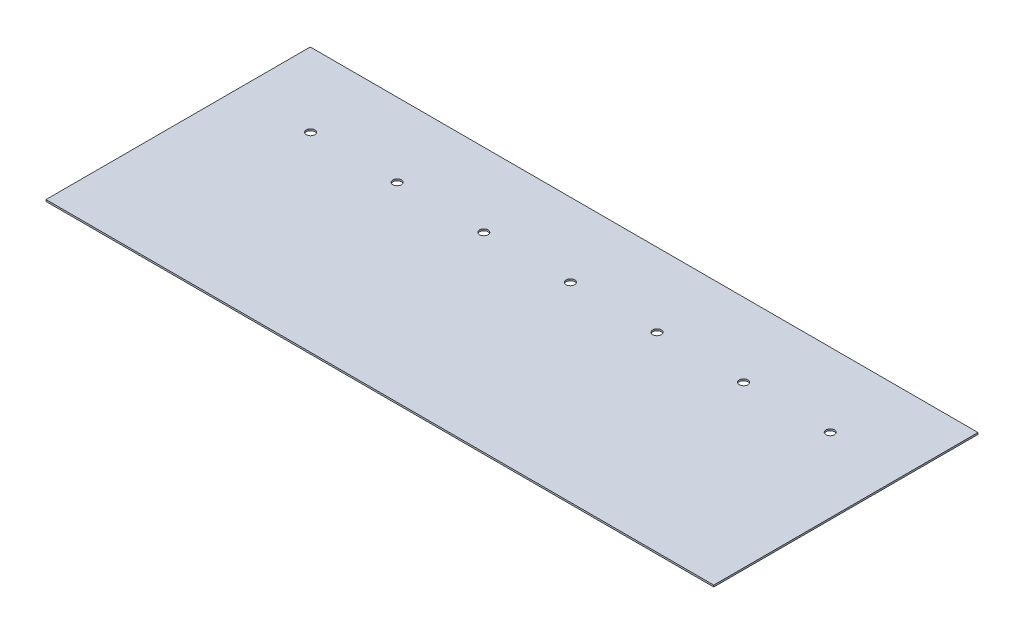
ISO-10303-21;
HEADER;
FILE_DESCRIPTION(('STEP AP214'),'2;1');
FILE_NAME('part.step','',(''),(''),'','','');
FILE_SCHEMA(('AUTOMOTIVE_DESIGN { 1 0 10303 214 1 1 1 1 }'));
ENDSEC;
DATA;
#1=APPLICATION_CONTEXT('core data for automotive mechanical design processes');
#2=APPLICATION_PROTOCOL_DEFINITION('international standard','automotive_design',2000,#1);
#3=PRODUCT_CONTEXT('',#1,'mechanical');
#4=PRODUCT('Part','Part','',(#3));
#5=PRODUCT_RELATED_PRODUCT_CATEGORY('part','',(#4));
#6=PRODUCT_DEFINITION_FORMATION('','',#4);
#7=PRODUCT_DEFINITION_CONTEXT('part definition',#1,'design');
#8=PRODUCT_DEFINITION('design','',#6,#7);
#9=PRODUCT_DEFINITION_SHAPE('','',#8);
#10=(LENGTH_UNIT() NAMED_UNIT(*) SI_UNIT(.MILLI.,.METRE.));
#11=(NAMED_UNIT(*) PLANE_ANGLE_UNIT() SI_UNIT($,.RADIAN.));
#12=(NAMED_UNIT(*) SI_UNIT($,.STERADIAN.) SOLID_ANGLE_UNIT());
#13=UNCERTAINTY_MEASURE_WITH_UNIT(LENGTH_MEASURE(1.E-05),#10,'distance_accuracy_value','');
#14=(GEOMETRIC_REPRESENTATION_CONTEXT(3) GLOBAL_UNCERTAINTY_ASSIGNED_CONTEXT((#13)) GLOBAL_UNIT_ASSIGNED_CONTEXT((#10,
#11,#12)) REPRESENTATION_CONTEXT('',''));
#15=CARTESIAN_POINT('',(0.,0.,0.));
#16=DIRECTION('',(0.,0.,1.));
#17=DIRECTION('',(1.,0.,0.));
#18=AXIS2_PLACEMENT_3D('',#15,#16,#17);
#19=CARTESIAN_POINT('',(391.668,-1.,0.));
#20=DIRECTION('',(-1.,0.,0.));
#21=DIRECTION('',(0.,0.,1.));
#22=AXIS2_PLACEMENT_3D('',#19,#20,#21);
#23=PLANE('',#22);
#24=DIRECTION('',(0.,0.,1.));
#25=VECTOR('',#24,1.);
#26=CARTESIAN_POINT('',(391.668,-1.,0.));
#27=LINE('',#26,#25);
#28=CARTESIAN_POINT('',(391.668,-1.,45.));
#29=VERTEX_POINT('',#28);
#30=CARTESIAN_POINT('',(391.668,-1.,199.9996));
#31=VERTEX_POINT('',#30);
#32=EDGE_CURVE('E62',#29,#31,#27,.T.);
#33=ORIENTED_EDGE('',*,*,#32,.F.);
#34=DIRECTION('',(0.,1.,0.));
#35=VECTOR('',#34,1.);
#36=CARTESIAN_POINT('',(391.668,-1.,45.));
#37=LINE('',#36,#35);
#38=CARTESIAN_POINT('',(391.668,0.,45.));
#39=VERTEX_POINT('',#38);
#40=EDGE_CURVE('E80',#29,#39,#37,.T.);
#41=ORIENTED_EDGE('',*,*,#40,.T.);
#42=DIRECTION('',(0.,0.,1.));
#43=VECTOR('',#42,1.);
#44=CARTESIAN_POINT('',(391.668,0.,0.));
#45=LINE('',#44,#43);
#46=CARTESIAN_POINT('',(391.668,0.,199.9996));
#47=VERTEX_POINT('',#46);
#48=EDGE_CURVE('E76',#39,#47,#45,.T.);
#49=ORIENTED_EDGE('',*,*,#48,.T.);
#50=DIRECTION('',(0.,1.,0.));
#51=VECTOR('',#50,1.);
#52=CARTESIAN_POINT('',(391.668,-1.,199.9996));
#53=LINE('',#52,#51);
#54=EDGE_CURVE('E47',#31,#47,#53,.T.);
#55=ORIENTED_EDGE('',*,*,#54,.F.);
#56=EDGE_LOOP('',(#33,#41,#49,#55));
#57=FACE_BOUND('',#56,.T.);
#58=ADVANCED_FACE('F39',(#57),#23,.F.);
#59=CARTESIAN_POINT('',(0.,-1.,199.9996));
#60=DIRECTION('',(0.,0.,1.));
#61=DIRECTION('',(1.,0.,0.));
#62=AXIS2_PLACEMENT_3D('',#59,#60,#61);
#63=PLANE('',#62);
#64=DIRECTION('',(1.,0.,0.));
#65=VECTOR('',#64,1.);
#66=CARTESIAN_POINT('',(0.,0.,199.9996));
#67=LINE('',#66,#65);
#68=CARTESIAN_POINT('',(0.,0.,199.9996));
#69=VERTEX_POINT('',#68);
#70=EDGE_CURVE('E90',#69,#47,#67,.T.);
#71=ORIENTED_EDGE('',*,*,#70,.F.);
#72=DIRECTION('',(0.,1.,0.));
#73=VECTOR('',#72,1.);
#74=CARTESIAN_POINT('',(0.,-1.,199.9996));
#75=LINE('',#74,#73);
#76=CARTESIAN_POINT('',(0.,-1.,199.9996));
#77=VERTEX_POINT('',#76);
#78=EDGE_CURVE('E92',#77,#69,#75,.T.);
#79=ORIENTED_EDGE('',*,*,#78,.F.);
#80=DIRECTION('',(1.,0.,0.));
#81=VECTOR('',#80,1.);
#82=CARTESIAN_POINT('',(0.,-1.,199.9996));
#83=LINE('',#82,#81);
#84=EDGE_CURVE('E91',#77,#31,#83,.T.);
#85=ORIENTED_EDGE('',*,*,#84,.T.);
#86=ORIENTED_EDGE('',*,*,#54,.T.);
#87=EDGE_LOOP('',(#71,#79,#85,#86));
#88=FACE_BOUND('',#87,.T.);
#89=ADVANCED_FACE('F88',(#88),#63,.T.);
#90=CARTESIAN_POINT('',(0.,-1.,0.));
#91=DIRECTION('',(-1.,0.,0.));
#92=DIRECTION('',(0.,0.,1.));
#93=AXIS2_PLACEMENT_3D('',#90,#91,#92);
#94=PLANE('',#93);
#95=DIRECTION('',(0.,1.,0.));
#96=VECTOR('',#95,1.);
#97=CARTESIAN_POINT('',(0.,-1.,45.));
#98=LINE('',#97,#96);
#99=CARTESIAN_POINT('',(0.,-1.,45.));
#100=VERTEX_POINT('',#99);
#101=CARTESIAN_POINT('',(0.,0.,45.));
#102=VERTEX_POINT('',#101);
#103=EDGE_CURVE('E53',#100,#102,#98,.T.);
#104=ORIENTED_EDGE('',*,*,#103,.F.);
#105=DIRECTION('',(0.,0.,1.));
#106=VECTOR('',#105,1.);
#107=CARTESIAN_POINT('',(0.,-1.,0.));
#108=LINE('',#107,#106);
#109=EDGE_CURVE('E105',#100,#77,#108,.T.);
#110=ORIENTED_EDGE('',*,*,#109,.T.);
#111=ORIENTED_EDGE('',*,*,#78,.T.);
#112=DIRECTION('',(0.,0.,1.));
#113=VECTOR('',#112,1.);
#114=CARTESIAN_POINT('',(0.,0.,0.));
#115=LINE('',#114,#113);
#116=EDGE_CURVE('E83',#102,#69,#115,.T.);
#117=ORIENTED_EDGE('',*,*,#116,.F.);
#118=EDGE_LOOP('',(#104,#110,#111,#117));
#119=FACE_BOUND('',#118,.T.);
#120=ADVANCED_FACE('F150',(#119),#94,.T.);
#121=CARTESIAN_POINT('',(195.834,-1.,88.2396));
#122=DIRECTION('',(0.,1.,0.));
#123=DIRECTION('',(0.,0.,1.));
#124=AXIS2_PLACEMENT_3D('',#121,#122,#123);
#125=CYLINDRICAL_SURFACE('',#124,2.5);
#126=CARTESIAN_POINT('',(195.834,-1.,88.2396));
#127=DIRECTION('',(0.,1.,0.));
#128=DIRECTION('',(0.,0.,1.));
#129=AXIS2_PLACEMENT_3D('',#126,#127,#128);
#130=CIRCLE('',#129,2.5);
#131=CARTESIAN_POINT('',(195.834,-1.,90.7396));
#132=VERTEX_POINT('',#131);
#133=EDGE_CURVE('E211',#132,#132,#130,.T.);
#134=ORIENTED_EDGE('',*,*,#133,.F.);
#135=EDGE_LOOP('',(#134));
#136=FACE_BOUND('',#135,.T.);
#137=CARTESIAN_POINT('',(195.834,0.,88.2396));
#138=DIRECTION('',(0.,1.,0.));
#139=DIRECTION('',(0.,0.,1.));
#140=AXIS2_PLACEMENT_3D('',#137,#138,#139);
#141=CIRCLE('',#140,2.5);
#142=CARTESIAN_POINT('',(195.834,0.,90.7396));
#143=VERTEX_POINT('',#142);
#144=EDGE_CURVE('E84',#143,#143,#141,.T.);
#145=ORIENTED_EDGE('',*,*,#144,.T.);
#146=EDGE_LOOP('',(#145));
#147=FACE_BOUND('',#146,.T.);
#148=ADVANCED_FACE('F131',(#136,#147),#125,.F.);
#149=CARTESIAN_POINT('',(145.034,-1.,88.2396));
#150=DIRECTION('',(0.,1.,0.));
#151=DIRECTION('',(0.,0.,1.));
#152=AXIS2_PLACEMENT_3D('',#149,#150,#151);
#153=CYLINDRICAL_SURFACE('',#152,2.49999999999997);
#154=CARTESIAN_POINT('',(145.034,-1.,88.2396));
#155=DIRECTION('',(0.,1.,0.));
#156=DIRECTION('',(0.,0.,1.));
#157=AXIS2_PLACEMENT_3D('',#154,#155,#156);
#158=CIRCLE('',#157,2.49999999999997);
#159=CARTESIAN_POINT('',(145.034,-1.,90.7396));
#160=VERTEX_POINT('',#159);
#161=EDGE_CURVE('E208',#160,#160,#158,.T.);
#162=ORIENTED_EDGE('',*,*,#161,.F.);
#163=EDGE_LOOP('',(#162));
#164=FACE_BOUND('',#163,.T.);
#165=CARTESIAN_POINT('',(145.034,0.,88.2396));
#166=DIRECTION('',(0.,1.,0.));
#167=DIRECTION('',(0.,0.,1.));
#168=AXIS2_PLACEMENT_3D('',#165,#166,#167);
#169=CIRCLE('',#168,2.49999999999997);
#170=CARTESIAN_POINT('',(145.034,0.,90.7396));
#171=VERTEX_POINT('',#170);
#172=EDGE_CURVE('E125',#171,#171,#169,.T.);
#173=ORIENTED_EDGE('',*,*,#172,.T.);
#174=EDGE_LOOP('',(#173));
#175=FACE_BOUND('',#174,.T.);
#176=ADVANCED_FACE('F155',(#164,#175),#153,.F.);
#177=CARTESIAN_POINT('',(94.234,-1.,88.2396));
#178=DIRECTION('',(0.,1.,0.));
#179=DIRECTION('',(0.,0.,1.));
#180=AXIS2_PLACEMENT_3D('',#177,#178,#179);
#181=CYLINDRICAL_SURFACE('',#180,2.5);
#182=CARTESIAN_POINT('',(94.234,-1.,88.2396));
#183=DIRECTION('',(0.,1.,0.));
#184=DIRECTION('',(0.,0.,1.));
#185=AXIS2_PLACEMENT_3D('',#182,#183,#184);
#186=CIRCLE('',#185,2.5);
#187=CARTESIAN_POINT('',(94.234,-1.,90.7396));
#188=VERTEX_POINT('',#187);
#189=EDGE_CURVE('E205',#188,#188,#186,.T.);
#190=ORIENTED_EDGE('',*,*,#189,.F.);
#191=EDGE_LOOP('',(#190));
#192=FACE_BOUND('',#191,.T.);
#193=CARTESIAN_POINT('',(94.234,0.,88.2396));
#194=DIRECTION('',(0.,1.,0.));
#195=DIRECTION('',(0.,0.,1.));
#196=AXIS2_PLACEMENT_3D('',#193,#194,#195);
#197=CIRCLE('',#196,2.5);
#198=CARTESIAN_POINT('',(94.234,0.,90.7396));
#199=VERTEX_POINT('',#198);
#200=EDGE_CURVE('E122',#199,#199,#197,.T.);
#201=ORIENTED_EDGE('',*,*,#200,.T.);
#202=EDGE_LOOP('',(#201));
#203=FACE_BOUND('',#202,.T.);
#204=ADVANCED_FACE('F159',(#192,#203),#181,.F.);
#205=CARTESIAN_POINT('',(43.434,-1.,88.2396));
#206=DIRECTION('',(0.,1.,0.));
#207=DIRECTION('',(0.,0.,1.));
#208=AXIS2_PLACEMENT_3D('',#205,#206,#207);
#209=CYLINDRICAL_SURFACE('',#208,2.5);
#210=CARTESIAN_POINT('',(43.434,-1.,88.2396));
#211=DIRECTION('',(0.,1.,0.));
#212=DIRECTION('',(0.,0.,1.));
#213=AXIS2_PLACEMENT_3D('',#210,#211,#212);
#214=CIRCLE('',#213,2.5);
#215=CARTESIAN_POINT('',(43.434,-1.,90.7396));
#216=VERTEX_POINT('',#215);
#217=EDGE_CURVE('E199',#216,#216,#214,.T.);
#218=ORIENTED_EDGE('',*,*,#217,.F.);
#219=EDGE_LOOP('',(#218));
#220=FACE_BOUND('',#219,.T.);
#221=CARTESIAN_POINT('',(43.434,0.,88.2396));
#222=DIRECTION('',(0.,1.,0.));
#223=DIRECTION('',(0.,0.,1.));
#224=AXIS2_PLACEMENT_3D('',#221,#222,#223);
#225=CIRCLE('',#224,2.5);
#226=CARTESIAN_POINT('',(43.434,0.,90.7396));
#227=VERTEX_POINT('',#226);
#228=EDGE_CURVE('E119',#227,#227,#225,.T.);
#229=ORIENTED_EDGE('',*,*,#228,.T.);
#230=EDGE_LOOP('',(#229));
#231=FACE_BOUND('',#230,.T.);
#232=ADVANCED_FACE('F163',(#220,#231),#209,.F.);
#233=CARTESIAN_POINT('',(246.634,-1.,88.2396));
#234=DIRECTION('',(0.,1.,0.));
#235=DIRECTION('',(0.,0.,1.));
#236=AXIS2_PLACEMENT_3D('',#233,#234,#235);
#237=CYLINDRICAL_SURFACE('',#236,2.50000000000002);
#238=CARTESIAN_POINT('',(246.634,-1.,88.2396));
#239=DIRECTION('',(0.,1.,0.));
#240=DIRECTION('',(0.,0.,1.));
#241=AXIS2_PLACEMENT_3D('',#238,#239,#240);
#242=CIRCLE('',#241,2.50000000000002);
#243=CARTESIAN_POINT('',(246.634,-1.,90.7396));
#244=VERTEX_POINT('',#243);
#245=EDGE_CURVE('E196',#244,#244,#242,.T.);
#246=ORIENTED_EDGE('',*,*,#245,.F.);
#247=EDGE_LOOP('',(#246));
#248=FACE_BOUND('',#247,.T.);
#249=CARTESIAN_POINT('',(246.634,0.,88.2396));
#250=DIRECTION('',(0.,1.,0.));
#251=DIRECTION('',(0.,0.,1.));
#252=AXIS2_PLACEMENT_3D('',#249,#250,#251);
#253=CIRCLE('',#252,2.50000000000002);
#254=CARTESIAN_POINT('',(246.634,0.,90.7396));
#255=VERTEX_POINT('',#254);
#256=EDGE_CURVE('E116',#255,#255,#253,.T.);
#257=ORIENTED_EDGE('',*,*,#256,.T.);
#258=EDGE_LOOP('',(#257));
#259=FACE_BOUND('',#258,.T.);
#260=ADVANCED_FACE('F167',(#248,#259),#237,.F.);
#261=CARTESIAN_POINT('',(297.434,-1.,88.2396));
#262=DIRECTION('',(0.,1.,0.));
#263=DIRECTION('',(0.,0.,1.));
#264=AXIS2_PLACEMENT_3D('',#261,#262,#263);
#265=CYLINDRICAL_SURFACE('',#264,2.49999999999997);
#266=CARTESIAN_POINT('',(297.434,-1.,88.2396));
#267=DIRECTION('',(0.,1.,0.));
#268=DIRECTION('',(0.,0.,1.));
#269=AXIS2_PLACEMENT_3D('',#266,#267,#268);
#270=CIRCLE('',#269,2.49999999999997);
#271=CARTESIAN_POINT('',(297.434,-1.,90.7396));
#272=VERTEX_POINT('',#271);
#273=EDGE_CURVE('E101',#272,#272,#270,.T.);
#274=ORIENTED_EDGE('',*,*,#273,.F.);
#275=EDGE_LOOP('',(#274));
#276=FACE_BOUND('',#275,.T.);
#277=CARTESIAN_POINT('',(297.434,0.,88.2396));
#278=DIRECTION('',(0.,1.,0.));
#279=DIRECTION('',(0.,0.,1.));
#280=AXIS2_PLACEMENT_3D('',#277,#278,#279);
#281=CIRCLE('',#280,2.49999999999997);
#282=CARTESIAN_POINT('',(297.434,0.,90.7396));
#283=VERTEX_POINT('',#282);
#284=EDGE_CURVE('E113',#283,#283,#281,.T.);
#285=ORIENTED_EDGE('',*,*,#284,.T.);
#286=EDGE_LOOP('',(#285));
#287=FACE_BOUND('',#286,.T.);
#288=ADVANCED_FACE('F170',(#276,#287),#265,.F.);
#289=CARTESIAN_POINT('',(348.234,-1.,88.2396));
#290=DIRECTION('',(0.,1.,0.));
#291=DIRECTION('',(0.,0.,1.));
#292=AXIS2_PLACEMENT_3D('',#289,#290,#291);
#293=CYLINDRICAL_SURFACE('',#292,2.50000000000002);
#294=CARTESIAN_POINT('',(348.234,-1.,88.2396));
#295=DIRECTION('',(0.,1.,0.));
#296=DIRECTION('',(0.,0.,1.));
#297=AXIS2_PLACEMENT_3D('',#294,#295,#296);
#298=CIRCLE('',#297,2.50000000000002);
#299=CARTESIAN_POINT('',(348.234,-1.,90.7396));
#300=VERTEX_POINT('',#299);
#301=EDGE_CURVE('E98',#300,#300,#298,.T.);
#302=ORIENTED_EDGE('',*,*,#301,.F.);
#303=EDGE_LOOP('',(#302));
#304=FACE_BOUND('',#303,.T.);
#305=CARTESIAN_POINT('',(348.234,0.,88.2396));
#306=DIRECTION('',(0.,1.,0.));
#307=DIRECTION('',(0.,0.,1.));
#308=AXIS2_PLACEMENT_3D('',#305,#306,#307);
#309=CIRCLE('',#308,2.50000000000002);
#310=CARTESIAN_POINT('',(348.234,0.,90.7396));
#311=VERTEX_POINT('',#310);
#312=EDGE_CURVE('E110',#311,#311,#309,.T.);
#313=ORIENTED_EDGE('',*,*,#312,.T.);
#314=EDGE_LOOP('',(#313));
#315=FACE_BOUND('',#314,.T.);
#316=ADVANCED_FACE('F41',(#304,#315),#293,.F.);
#317=CARTESIAN_POINT('',(0.,-1.,0.));
#318=DIRECTION('',(0.,1.,0.));
#319=DIRECTION('',(0.,0.,1.));
#320=AXIS2_PLACEMENT_3D('',#317,#318,#319);
#321=PLANE('',#320);
#322=ORIENTED_EDGE('',*,*,#301,.T.);
#323=EDGE_LOOP('',(#322));
#324=FACE_BOUND('',#323,.T.);
#325=ORIENTED_EDGE('',*,*,#273,.T.);
#326=EDGE_LOOP('',(#325));
#327=FACE_BOUND('',#326,.T.);
#328=ORIENTED_EDGE('',*,*,#245,.T.);
#329=EDGE_LOOP('',(#328));
#330=FACE_BOUND('',#329,.T.);
#331=ORIENTED_EDGE('',*,*,#217,.T.);
#332=EDGE_LOOP('',(#331));
#333=FACE_BOUND('',#332,.T.);
#334=ORIENTED_EDGE('',*,*,#189,.T.);
#335=EDGE_LOOP('',(#334));
#336=FACE_BOUND('',#335,.T.);
#337=ORIENTED_EDGE('',*,*,#161,.T.);
#338=EDGE_LOOP('',(#337));
#339=FACE_BOUND('',#338,.T.);
#340=ORIENTED_EDGE('',*,*,#133,.T.);
#341=EDGE_LOOP('',(#340));
#342=FACE_BOUND('',#341,.T.);
#343=ORIENTED_EDGE('',*,*,#109,.F.);
#344=DIRECTION('',(1.,0.,0.));
#345=VECTOR('',#344,1.);
#346=CARTESIAN_POINT('',(0.,-1.,45.));
#347=LINE('',#346,#345);
#348=EDGE_CURVE('E218',#100,#29,#347,.T.);
#349=ORIENTED_EDGE('',*,*,#348,.T.);
#350=ORIENTED_EDGE('',*,*,#32,.T.);
#351=ORIENTED_EDGE('',*,*,#84,.F.);
#352=EDGE_LOOP('',(#343,#349,#350,#351));
#353=FACE_BOUND('',#352,.T.);
#354=ADVANCED_FACE('F135',(#324,#327,#330,#333,#336,#339,#342,#353),#321,.F.);
#355=CARTESIAN_POINT('',(0.,0.,0.));
#356=DIRECTION('',(0.,1.,0.));
#357=DIRECTION('',(0.,0.,1.));
#358=AXIS2_PLACEMENT_3D('',#355,#356,#357);
#359=PLANE('',#358);
#360=DIRECTION('',(1.,0.,0.));
#361=VECTOR('',#360,1.);
#362=CARTESIAN_POINT('',(0.,0.,45.));
#363=LINE('',#362,#361);
#364=EDGE_CURVE('E11',#102,#39,#363,.T.);
#365=ORIENTED_EDGE('',*,*,#364,.F.);
#366=ORIENTED_EDGE('',*,*,#116,.T.);
#367=ORIENTED_EDGE('',*,*,#70,.T.);
#368=ORIENTED_EDGE('',*,*,#48,.F.);
#369=EDGE_LOOP('',(#365,#366,#367,#368));
#370=FACE_BOUND('',#369,.T.);
#371=ORIENTED_EDGE('',*,*,#312,.F.);
#372=EDGE_LOOP('',(#371));
#373=FACE_BOUND('',#372,.T.);
#374=ORIENTED_EDGE('',*,*,#284,.F.);
#375=EDGE_LOOP('',(#374));
#376=FACE_BOUND('',#375,.T.);
#377=ORIENTED_EDGE('',*,*,#256,.F.);
#378=EDGE_LOOP('',(#377));
#379=FACE_BOUND('',#378,.T.);
#380=ORIENTED_EDGE('',*,*,#228,.F.);
#381=EDGE_LOOP('',(#380));
#382=FACE_BOUND('',#381,.T.);
#383=ORIENTED_EDGE('',*,*,#200,.F.);
#384=EDGE_LOOP('',(#383));
#385=FACE_BOUND('',#384,.T.);
#386=ORIENTED_EDGE('',*,*,#172,.F.);
#387=EDGE_LOOP('',(#386));
#388=FACE_BOUND('',#387,.T.);
#389=ORIENTED_EDGE('',*,*,#144,.F.);
#390=EDGE_LOOP('',(#389));
#391=FACE_BOUND('',#390,.T.);
#392=ADVANCED_FACE('F94',(#370,#373,#376,#379,#382,#385,#388,#391),#359,.T.);
#393=CARTESIAN_POINT('',(0.,-1.,45.));
#394=DIRECTION('',(0.,0.,1.));
#395=DIRECTION('',(1.,0.,0.));
#396=AXIS2_PLACEMENT_3D('',#393,#394,#395);
#397=PLANE('',#396);
#398=ORIENTED_EDGE('',*,*,#364,.T.);
#399=ORIENTED_EDGE('',*,*,#40,.F.);
#400=ORIENTED_EDGE('',*,*,#348,.F.);
#401=ORIENTED_EDGE('',*,*,#103,.T.);
#402=EDGE_LOOP('',(#398,#399,#400,#401));
#403=FACE_BOUND('',#402,.T.);
#404=ADVANCED_FACE('F134',(#403),#397,.F.);
#405=CLOSED_SHELL('',(#58,#89,#120,#148,#176,#204,#232,#260,#288,#316,#354,#392,#404));
#406=MANIFOLD_SOLID_BREP('B2',#405);
#407=ADVANCED_BREP_SHAPE_REPRESENTATION('',(#18,#406),#14);
#408=SHAPE_DEFINITION_REPRESENTATION(#9,#407);
ENDSEC;
END-ISO-10303-21;
